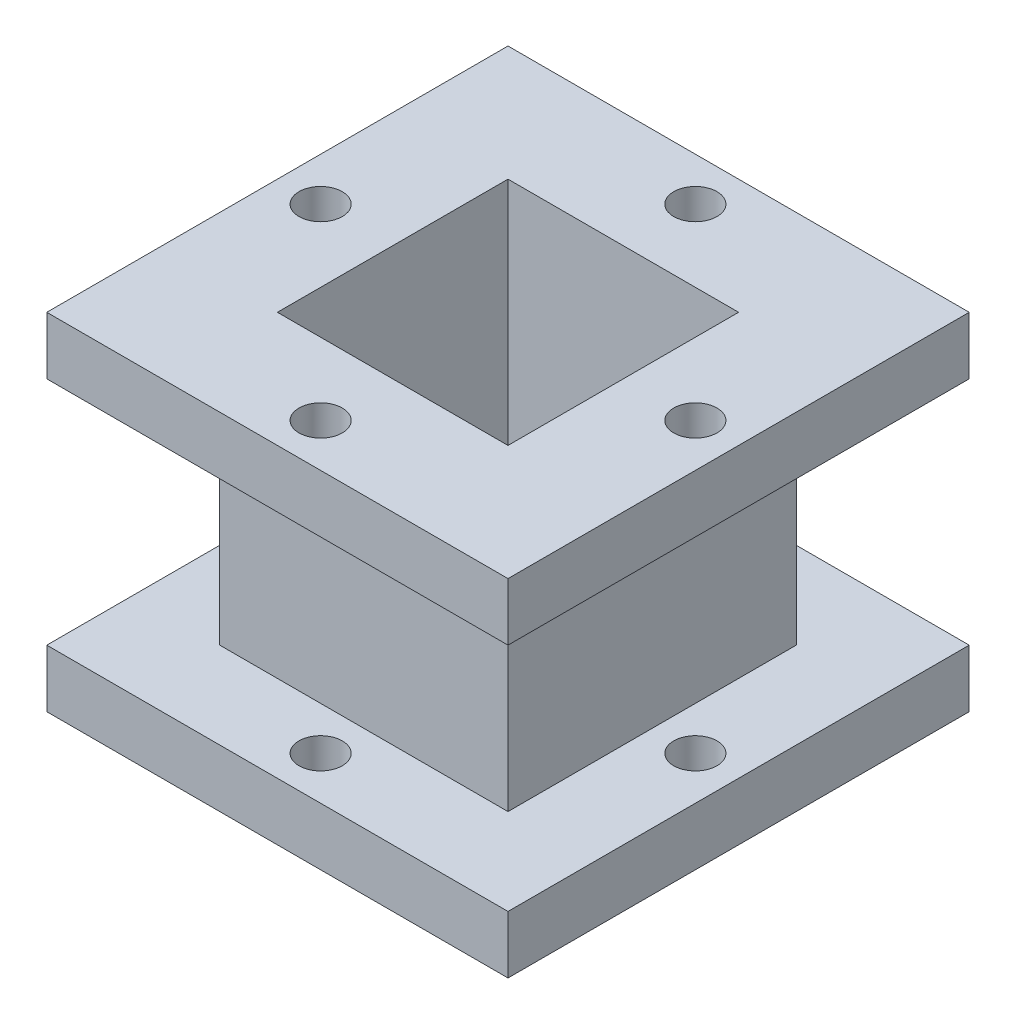
ISO-10303-21;
HEADER;
FILE_DESCRIPTION(('STEP AP214'),'2;1');
FILE_NAME('part.step','',(''),(''),'','','');
FILE_SCHEMA(('AUTOMOTIVE_DESIGN { 1 0 10303 214 1 1 1 1 }'));
ENDSEC;
DATA;
#1=APPLICATION_CONTEXT('core data for automotive mechanical design processes');
#2=APPLICATION_PROTOCOL_DEFINITION('international standard','automotive_design',2000,#1);
#3=PRODUCT_CONTEXT('',#1,'mechanical');
#4=PRODUCT('Part','Part','',(#3));
#5=PRODUCT_RELATED_PRODUCT_CATEGORY('part','',(#4));
#6=PRODUCT_DEFINITION_FORMATION('','',#4);
#7=PRODUCT_DEFINITION_CONTEXT('part definition',#1,'design');
#8=PRODUCT_DEFINITION('design','',#6,#7);
#9=PRODUCT_DEFINITION_SHAPE('','',#8);
#10=(LENGTH_UNIT() NAMED_UNIT(*) SI_UNIT(.MILLI.,.METRE.));
#11=(NAMED_UNIT(*) PLANE_ANGLE_UNIT() SI_UNIT($,.RADIAN.));
#12=(NAMED_UNIT(*) SI_UNIT($,.STERADIAN.) SOLID_ANGLE_UNIT());
#13=UNCERTAINTY_MEASURE_WITH_UNIT(LENGTH_MEASURE(1.E-05),#10,'distance_accuracy_value','');
#14=(GEOMETRIC_REPRESENTATION_CONTEXT(3) GLOBAL_UNCERTAINTY_ASSIGNED_CONTEXT((#13)) GLOBAL_UNIT_ASSIGNED_CONTEXT((#10,
#11,#12)) REPRESENTATION_CONTEXT('',''));
#15=CARTESIAN_POINT('',(0.,0.,0.));
#16=DIRECTION('',(0.,0.,1.));
#17=DIRECTION('',(1.,0.,0.));
#18=AXIS2_PLACEMENT_3D('',#15,#16,#17);
#19=CARTESIAN_POINT('',(25.908,6.096,25.908));
#20=DIRECTION('',(-1.,0.,0.));
#21=DIRECTION('',(0.,0.,1.));
#22=AXIS2_PLACEMENT_3D('',#19,#20,#21);
#23=PLANE('',#22);
#24=DIRECTION('',(0.,0.,-1.));
#25=VECTOR('',#24,1.);
#26=CARTESIAN_POINT('',(25.908,-0.381000000000001,25.908));
#27=LINE('',#26,#25);
#28=CARTESIAN_POINT('',(25.908,-0.381000000000001,25.908));
#29=VERTEX_POINT('',#28);
#30=CARTESIAN_POINT('',(25.908,-0.381000000000001,-25.908));
#31=VERTEX_POINT('',#30);
#32=EDGE_CURVE('E243',#29,#31,#27,.T.);
#33=ORIENTED_EDGE('',*,*,#32,.T.);
#34=DIRECTION('',(0.,-1.,0.));
#35=VECTOR('',#34,1.);
#36=CARTESIAN_POINT('',(25.908,6.096,-25.908));
#37=LINE('',#36,#35);
#38=CARTESIAN_POINT('',(25.908,6.096,-25.908));
#39=VERTEX_POINT('',#38);
#40=EDGE_CURVE('E11',#39,#31,#37,.T.);
#41=ORIENTED_EDGE('',*,*,#40,.F.);
#42=DIRECTION('',(0.,0.,-1.));
#43=VECTOR('',#42,1.);
#44=CARTESIAN_POINT('',(25.908,6.096,25.908));
#45=LINE('',#44,#43);
#46=CARTESIAN_POINT('',(25.908,6.096,25.908));
#47=VERTEX_POINT('',#46);
#48=EDGE_CURVE('E250',#47,#39,#45,.T.);
#49=ORIENTED_EDGE('',*,*,#48,.F.);
#50=DIRECTION('',(0.,-1.,0.));
#51=VECTOR('',#50,1.);
#52=CARTESIAN_POINT('',(25.908,6.096,25.908));
#53=LINE('',#52,#51);
#54=EDGE_CURVE('E260',#47,#29,#53,.T.);
#55=ORIENTED_EDGE('',*,*,#54,.T.);
#56=EDGE_LOOP('',(#33,#41,#49,#55));
#57=FACE_BOUND('',#56,.T.);
#58=ADVANCED_FACE('F36',(#57),#23,.F.);
#59=CARTESIAN_POINT('',(-25.908,6.096,-25.908));
#60=DIRECTION('',(0.,0.,1.));
#61=DIRECTION('',(1.,0.,0.));
#62=AXIS2_PLACEMENT_3D('',#59,#60,#61);
#63=PLANE('',#62);
#64=DIRECTION('',(-1.,0.,0.));
#65=VECTOR('',#64,1.);
#66=CARTESIAN_POINT('',(-25.908,-0.381000000000001,-25.908));
#67=LINE('',#66,#65);
#68=CARTESIAN_POINT('',(-25.908,-0.381000000000001,-25.908));
#69=VERTEX_POINT('',#68);
#70=EDGE_CURVE('E263',#31,#69,#67,.T.);
#71=ORIENTED_EDGE('',*,*,#70,.T.);
#72=DIRECTION('',(0.,-1.,0.));
#73=VECTOR('',#72,1.);
#74=CARTESIAN_POINT('',(-25.908,6.096,-25.908));
#75=LINE('',#74,#73);
#76=CARTESIAN_POINT('',(-25.908,6.096,-25.908));
#77=VERTEX_POINT('',#76);
#78=EDGE_CURVE('E43',#77,#69,#75,.T.);
#79=ORIENTED_EDGE('',*,*,#78,.F.);
#80=DIRECTION('',(-1.,0.,0.));
#81=VECTOR('',#80,1.);
#82=CARTESIAN_POINT('',(-25.908,6.096,-25.908));
#83=LINE('',#82,#81);
#84=EDGE_CURVE('E253',#39,#77,#83,.T.);
#85=ORIENTED_EDGE('',*,*,#84,.F.);
#86=ORIENTED_EDGE('',*,*,#40,.T.);
#87=EDGE_LOOP('',(#71,#79,#85,#86));
#88=FACE_BOUND('',#87,.T.);
#89=ADVANCED_FACE('F291',(#88),#63,.F.);
#90=CARTESIAN_POINT('',(-25.908,6.096,25.908));
#91=DIRECTION('',(1.,0.,0.));
#92=DIRECTION('',(0.,0.,-1.));
#93=AXIS2_PLACEMENT_3D('',#90,#91,#92);
#94=PLANE('',#93);
#95=DIRECTION('',(0.,0.,1.));
#96=VECTOR('',#95,1.);
#97=CARTESIAN_POINT('',(-25.908,-0.381000000000001,25.908));
#98=LINE('',#97,#96);
#99=CARTESIAN_POINT('',(-25.908,-0.381000000000001,25.908));
#100=VERTEX_POINT('',#99);
#101=EDGE_CURVE('E265',#69,#100,#98,.T.);
#102=ORIENTED_EDGE('',*,*,#101,.T.);
#103=DIRECTION('',(0.,-1.,0.));
#104=VECTOR('',#103,1.);
#105=CARTESIAN_POINT('',(-25.908,6.096,25.908));
#106=LINE('',#105,#104);
#107=CARTESIAN_POINT('',(-25.908,6.096,25.908));
#108=VERTEX_POINT('',#107);
#109=EDGE_CURVE('E270',#108,#100,#106,.T.);
#110=ORIENTED_EDGE('',*,*,#109,.F.);
#111=DIRECTION('',(0.,0.,1.));
#112=VECTOR('',#111,1.);
#113=CARTESIAN_POINT('',(-25.908,6.096,25.908));
#114=LINE('',#113,#112);
#115=EDGE_CURVE('E256',#77,#108,#114,.T.);
#116=ORIENTED_EDGE('',*,*,#115,.F.);
#117=ORIENTED_EDGE('',*,*,#78,.T.);
#118=EDGE_LOOP('',(#102,#110,#116,#117));
#119=FACE_BOUND('',#118,.T.);
#120=ADVANCED_FACE('F277',(#119),#94,.F.);
#121=CARTESIAN_POINT('',(-25.908,6.096,25.908));
#122=DIRECTION('',(0.,0.,-1.));
#123=DIRECTION('',(-1.,0.,0.));
#124=AXIS2_PLACEMENT_3D('',#121,#122,#123);
#125=PLANE('',#124);
#126=DIRECTION('',(1.,0.,0.));
#127=VECTOR('',#126,1.);
#128=CARTESIAN_POINT('',(-25.908,-0.381000000000001,25.908));
#129=LINE('',#128,#127);
#130=EDGE_CURVE('E254',#100,#29,#129,.T.);
#131=ORIENTED_EDGE('',*,*,#130,.T.);
#132=ORIENTED_EDGE('',*,*,#54,.F.);
#133=DIRECTION('',(1.,0.,0.));
#134=VECTOR('',#133,1.);
#135=CARTESIAN_POINT('',(-25.908,6.096,25.908));
#136=LINE('',#135,#134);
#137=EDGE_CURVE('E258',#108,#47,#136,.T.);
#138=ORIENTED_EDGE('',*,*,#137,.F.);
#139=ORIENTED_EDGE('',*,*,#109,.T.);
#140=EDGE_LOOP('',(#131,#132,#138,#139));
#141=FACE_BOUND('',#140,.T.);
#142=ADVANCED_FACE('F284',(#141),#125,.F.);
#143=CARTESIAN_POINT('',(0.,6.096,0.));
#144=DIRECTION('',(0.,-1.,0.));
#145=DIRECTION('',(0.,0.,-1.));
#146=AXIS2_PLACEMENT_3D('',#143,#144,#145);
#147=PLANE('',#146);
#148=CARTESIAN_POINT('',(21.05025,6.096,0.));
#149=DIRECTION('',(0.,-1.,0.));
#150=DIRECTION('',(0.,0.,-1.));
#151=AXIS2_PLACEMENT_3D('',#148,#149,#150);
#152=CIRCLE('',#151,2.428875);
#153=CARTESIAN_POINT('',(21.05025,6.096,-2.42887500000007));
#154=VERTEX_POINT('',#153);
#155=EDGE_CURVE('E395',#154,#154,#152,.T.);
#156=ORIENTED_EDGE('',*,*,#155,.T.);
#157=EDGE_LOOP('',(#156));
#158=FACE_BOUND('',#157,.T.);
#159=CARTESIAN_POINT('',(0.,6.096,-21.05025));
#160=DIRECTION('',(0.,-1.,0.));
#161=DIRECTION('',(0.,0.,-1.));
#162=AXIS2_PLACEMENT_3D('',#159,#160,#161);
#163=CIRCLE('',#162,2.428875);
#164=CARTESIAN_POINT('',(0.,6.096,-23.479125));
#165=VERTEX_POINT('',#164);
#166=EDGE_CURVE('E402',#165,#165,#163,.T.);
#167=ORIENTED_EDGE('',*,*,#166,.T.);
#168=EDGE_LOOP('',(#167));
#169=FACE_BOUND('',#168,.T.);
#170=CARTESIAN_POINT('',(-21.05025,6.096,2.20581385564447E-13));
#171=DIRECTION('',(0.,-1.,0.));
#172=DIRECTION('',(0.,0.,-1.));
#173=AXIS2_PLACEMENT_3D('',#170,#171,#172);
#174=CIRCLE('',#173,2.428875);
#175=CARTESIAN_POINT('',(-21.05025,6.096,-2.42887499999978));
#176=VERTEX_POINT('',#175);
#177=EDGE_CURVE('E614',#176,#176,#174,.T.);
#178=ORIENTED_EDGE('',*,*,#177,.T.);
#179=EDGE_LOOP('',(#178));
#180=FACE_BOUND('',#179,.T.);
#181=CARTESIAN_POINT('',(0.,6.096,21.05025));
#182=DIRECTION('',(0.,-1.,0.));
#183=DIRECTION('',(0.,0.,-1.));
#184=AXIS2_PLACEMENT_3D('',#181,#182,#183);
#185=CIRCLE('',#184,2.428875);
#186=CARTESIAN_POINT('',(0.,6.096,18.621375));
#187=VERTEX_POINT('',#186);
#188=EDGE_CURVE('E172',#187,#187,#185,.T.);
#189=ORIENTED_EDGE('',*,*,#188,.T.);
#190=EDGE_LOOP('',(#189));
#191=FACE_BOUND('',#190,.T.);
#192=DIRECTION('',(0.,0.,-1.));
#193=VECTOR('',#192,1.);
#194=CARTESIAN_POINT('',(-16.1925,6.096,16.1925));
#195=LINE('',#194,#193);
#196=CARTESIAN_POINT('',(-16.1925,6.096,16.1925));
#197=VERTEX_POINT('',#196);
#198=CARTESIAN_POINT('',(-16.1925,6.096,-16.1925));
#199=VERTEX_POINT('',#198);
#200=EDGE_CURVE('E221',#197,#199,#195,.T.);
#201=ORIENTED_EDGE('',*,*,#200,.T.);
#202=DIRECTION('',(1.,0.,0.));
#203=VECTOR('',#202,1.);
#204=CARTESIAN_POINT('',(-16.1925,6.096,-16.1925));
#205=LINE('',#204,#203);
#206=CARTESIAN_POINT('',(16.1925,6.096,-16.1925));
#207=VERTEX_POINT('',#206);
#208=EDGE_CURVE('E217',#199,#207,#205,.T.);
#209=ORIENTED_EDGE('',*,*,#208,.T.);
#210=DIRECTION('',(0.,0.,-1.));
#211=VECTOR('',#210,1.);
#212=CARTESIAN_POINT('',(16.1925,6.096,16.1925));
#213=LINE('',#212,#211);
#214=CARTESIAN_POINT('',(16.1925,6.096,16.1925));
#215=VERTEX_POINT('',#214);
#216=EDGE_CURVE('E233',#215,#207,#213,.T.);
#217=ORIENTED_EDGE('',*,*,#216,.F.);
#218=DIRECTION('',(1.,0.,0.));
#219=VECTOR('',#218,1.);
#220=CARTESIAN_POINT('',(-16.1925,6.096,16.1925));
#221=LINE('',#220,#219);
#222=EDGE_CURVE('E236',#197,#215,#221,.T.);
#223=ORIENTED_EDGE('',*,*,#222,.F.);
#224=EDGE_LOOP('',(#201,#209,#217,#223));
#225=FACE_BOUND('',#224,.T.);
#226=ORIENTED_EDGE('',*,*,#48,.T.);
#227=ORIENTED_EDGE('',*,*,#84,.T.);
#228=ORIENTED_EDGE('',*,*,#115,.T.);
#229=ORIENTED_EDGE('',*,*,#137,.T.);
#230=EDGE_LOOP('',(#226,#227,#228,#229));
#231=FACE_BOUND('',#230,.T.);
#232=ADVANCED_FACE('F290',(#158,#169,#180,#191,#225,#231),#147,.F.);
#233=CARTESIAN_POINT('',(0.,-0.381000000000001,0.));
#234=DIRECTION('',(0.,-1.,0.));
#235=DIRECTION('',(0.,0.,-1.));
#236=AXIS2_PLACEMENT_3D('',#233,#234,#235);
#237=PLANE('',#236);
#238=CARTESIAN_POINT('',(21.05025,-0.381000000000001,0.));
#239=DIRECTION('',(0.,1.,0.));
#240=DIRECTION('',(1.,0.,0.));
#241=AXIS2_PLACEMENT_3D('',#238,#239,#240);
#242=CIRCLE('',#241,2.428875);
#243=CARTESIAN_POINT('',(23.479125,-0.381000000000001,0.));
#244=VERTEX_POINT('',#243);
#245=EDGE_CURVE('E392',#244,#244,#242,.T.);
#246=ORIENTED_EDGE('',*,*,#245,.T.);
#247=EDGE_LOOP('',(#246));
#248=FACE_BOUND('',#247,.T.);
#249=CARTESIAN_POINT('',(0.,-0.381000000000001,-21.05025));
#250=DIRECTION('',(0.,1.,0.));
#251=DIRECTION('',(0.,0.,-1.));
#252=AXIS2_PLACEMENT_3D('',#249,#250,#251);
#253=CIRCLE('',#252,2.428875);
#254=CARTESIAN_POINT('',(0.,-0.381000000000001,-23.479125));
#255=VERTEX_POINT('',#254);
#256=EDGE_CURVE('E629',#255,#255,#253,.T.);
#257=ORIENTED_EDGE('',*,*,#256,.T.);
#258=EDGE_LOOP('',(#257));
#259=FACE_BOUND('',#258,.T.);
#260=CARTESIAN_POINT('',(-21.05025,-0.381000000000001,2.20581385564447E-13));
#261=DIRECTION('',(0.,1.,0.));
#262=DIRECTION('',(-1.,0.,0.));
#263=AXIS2_PLACEMENT_3D('',#260,#261,#262);
#264=CIRCLE('',#263,2.428875);
#265=CARTESIAN_POINT('',(-23.479125,-0.381000000000001,2.46022500775095E-13));
#266=VERTEX_POINT('',#265);
#267=EDGE_CURVE('E623',#266,#266,#264,.T.);
#268=ORIENTED_EDGE('',*,*,#267,.T.);
#269=EDGE_LOOP('',(#268));
#270=FACE_BOUND('',#269,.T.);
#271=CARTESIAN_POINT('',(0.,-0.381000000000001,21.05025));
#272=DIRECTION('',(0.,1.,0.));
#273=DIRECTION('',(0.,0.,1.));
#274=AXIS2_PLACEMENT_3D('',#271,#272,#273);
#275=CIRCLE('',#274,2.428875);
#276=CARTESIAN_POINT('',(0.,-0.381000000000001,23.479125));
#277=VERTEX_POINT('',#276);
#278=EDGE_CURVE('E400',#277,#277,#275,.T.);
#279=ORIENTED_EDGE('',*,*,#278,.T.);
#280=EDGE_LOOP('',(#279));
#281=FACE_BOUND('',#280,.T.);
#282=DIRECTION('',(0.,0.,-1.));
#283=VECTOR('',#282,1.);
#284=CARTESIAN_POINT('',(12.954,-0.381000000000001,12.954));
#285=LINE('',#284,#283);
#286=CARTESIAN_POINT('',(12.954,-0.381000000000001,12.954));
#287=VERTEX_POINT('',#286);
#288=CARTESIAN_POINT('',(12.954,-0.381000000000001,-12.954));
#289=VERTEX_POINT('',#288);
#290=EDGE_CURVE('E150',#287,#289,#285,.T.);
#291=ORIENTED_EDGE('',*,*,#290,.T.);
#292=DIRECTION('',(-1.,0.,0.));
#293=VECTOR('',#292,1.);
#294=CARTESIAN_POINT('',(-12.954,-0.381000000000001,-12.954));
#295=LINE('',#294,#293);
#296=CARTESIAN_POINT('',(-12.954,-0.381000000000001,-12.954));
#297=VERTEX_POINT('',#296);
#298=EDGE_CURVE('E159',#289,#297,#295,.T.);
#299=ORIENTED_EDGE('',*,*,#298,.T.);
#300=DIRECTION('',(0.,0.,1.));
#301=VECTOR('',#300,1.);
#302=CARTESIAN_POINT('',(-12.954,-0.381000000000001,12.954));
#303=LINE('',#302,#301);
#304=CARTESIAN_POINT('',(-12.954,-0.381000000000001,12.954));
#305=VERTEX_POINT('',#304);
#306=EDGE_CURVE('E50',#297,#305,#303,.T.);
#307=ORIENTED_EDGE('',*,*,#306,.T.);
#308=DIRECTION('',(1.,0.,0.));
#309=VECTOR('',#308,1.);
#310=CARTESIAN_POINT('',(-12.954,-0.381000000000001,12.954));
#311=LINE('',#310,#309);
#312=EDGE_CURVE('E156',#305,#287,#311,.T.);
#313=ORIENTED_EDGE('',*,*,#312,.T.);
#314=EDGE_LOOP('',(#291,#299,#307,#313));
#315=FACE_BOUND('',#314,.T.);
#316=ORIENTED_EDGE('',*,*,#32,.F.);
#317=ORIENTED_EDGE('',*,*,#130,.F.);
#318=ORIENTED_EDGE('',*,*,#101,.F.);
#319=ORIENTED_EDGE('',*,*,#70,.F.);
#320=EDGE_LOOP('',(#316,#317,#318,#319));
#321=FACE_BOUND('',#320,.T.);
#322=ADVANCED_FACE('F163',(#248,#259,#270,#281,#315,#321),#237,.T.);
#323=CARTESIAN_POINT('',(-16.1925,32.004,-16.1925));
#324=DIRECTION('',(0.,0.,-1.));
#325=DIRECTION('',(-1.,0.,0.));
#326=AXIS2_PLACEMENT_3D('',#323,#324,#325);
#327=PLANE('',#326);
#328=ORIENTED_EDGE('',*,*,#208,.F.);
#329=DIRECTION('',(0.,-1.,0.));
#330=VECTOR('',#329,1.);
#331=CARTESIAN_POINT('',(-16.1925,32.004,-16.1925));
#332=LINE('',#331,#330);
#333=CARTESIAN_POINT('',(-16.1925,32.004,-16.1925));
#334=VERTEX_POINT('',#333);
#335=EDGE_CURVE('E240',#334,#199,#332,.T.);
#336=ORIENTED_EDGE('',*,*,#335,.F.);
#337=DIRECTION('',(1.,0.,0.));
#338=VECTOR('',#337,1.);
#339=CARTESIAN_POINT('',(-16.1925,32.004,-16.1925));
#340=LINE('',#339,#338);
#341=CARTESIAN_POINT('',(16.1925,32.004,-16.1925));
#342=VERTEX_POINT('',#341);
#343=EDGE_CURVE('E218',#334,#342,#340,.T.);
#344=ORIENTED_EDGE('',*,*,#343,.T.);
#345=DIRECTION('',(0.,-1.,0.));
#346=VECTOR('',#345,1.);
#347=CARTESIAN_POINT('',(16.1925,32.004,-16.1925));
#348=LINE('',#347,#346);
#349=EDGE_CURVE('E230',#342,#207,#348,.T.);
#350=ORIENTED_EDGE('',*,*,#349,.T.);
#351=EDGE_LOOP('',(#328,#336,#344,#350));
#352=FACE_BOUND('',#351,.T.);
#353=ADVANCED_FACE('F303',(#352),#327,.T.);
#354=CARTESIAN_POINT('',(-16.1925,32.004,16.1925));
#355=DIRECTION('',(-1.,0.,0.));
#356=DIRECTION('',(0.,0.,1.));
#357=AXIS2_PLACEMENT_3D('',#354,#355,#356);
#358=PLANE('',#357);
#359=ORIENTED_EDGE('',*,*,#200,.F.);
#360=DIRECTION('',(0.,-1.,0.));
#361=VECTOR('',#360,1.);
#362=CARTESIAN_POINT('',(-16.1925,32.004,16.1925));
#363=LINE('',#362,#361);
#364=CARTESIAN_POINT('',(-16.1925,32.004,16.1925));
#365=VERTEX_POINT('',#364);
#366=EDGE_CURVE('E244',#365,#197,#363,.T.);
#367=ORIENTED_EDGE('',*,*,#366,.F.);
#368=DIRECTION('',(0.,0.,-1.));
#369=VECTOR('',#368,1.);
#370=CARTESIAN_POINT('',(-16.1925,32.004,16.1925));
#371=LINE('',#370,#369);
#372=EDGE_CURVE('E227',#365,#334,#371,.T.);
#373=ORIENTED_EDGE('',*,*,#372,.T.);
#374=ORIENTED_EDGE('',*,*,#335,.T.);
#375=EDGE_LOOP('',(#359,#367,#373,#374));
#376=FACE_BOUND('',#375,.T.);
#377=ADVANCED_FACE('F310',(#376),#358,.T.);
#378=CARTESIAN_POINT('',(-16.1925,32.004,16.1925));
#379=DIRECTION('',(0.,0.,-1.));
#380=DIRECTION('',(-1.,0.,0.));
#381=AXIS2_PLACEMENT_3D('',#378,#379,#380);
#382=PLANE('',#381);
#383=ORIENTED_EDGE('',*,*,#222,.T.);
#384=DIRECTION('',(0.,-1.,0.));
#385=VECTOR('',#384,1.);
#386=CARTESIAN_POINT('',(16.1925,32.004,16.1925));
#387=LINE('',#386,#385);
#388=CARTESIAN_POINT('',(16.1925,32.004,16.1925));
#389=VERTEX_POINT('',#388);
#390=EDGE_CURVE('E246',#389,#215,#387,.T.);
#391=ORIENTED_EDGE('',*,*,#390,.F.);
#392=DIRECTION('',(1.,0.,0.));
#393=VECTOR('',#392,1.);
#394=CARTESIAN_POINT('',(-16.1925,32.004,16.1925));
#395=LINE('',#394,#393);
#396=EDGE_CURVE('E224',#365,#389,#395,.T.);
#397=ORIENTED_EDGE('',*,*,#396,.F.);
#398=ORIENTED_EDGE('',*,*,#366,.T.);
#399=EDGE_LOOP('',(#383,#391,#397,#398));
#400=FACE_BOUND('',#399,.T.);
#401=ADVANCED_FACE('F316',(#400),#382,.F.);
#402=CARTESIAN_POINT('',(16.1925,32.004,16.1925));
#403=DIRECTION('',(-1.,0.,0.));
#404=DIRECTION('',(0.,0.,1.));
#405=AXIS2_PLACEMENT_3D('',#402,#403,#404);
#406=PLANE('',#405);
#407=ORIENTED_EDGE('',*,*,#216,.T.);
#408=ORIENTED_EDGE('',*,*,#349,.F.);
#409=DIRECTION('',(0.,0.,-1.));
#410=VECTOR('',#409,1.);
#411=CARTESIAN_POINT('',(16.1925,32.004,16.1925));
#412=LINE('',#411,#410);
#413=EDGE_CURVE('E220',#389,#342,#412,.T.);
#414=ORIENTED_EDGE('',*,*,#413,.F.);
#415=ORIENTED_EDGE('',*,*,#390,.T.);
#416=EDGE_LOOP('',(#407,#408,#414,#415));
#417=FACE_BOUND('',#416,.T.);
#418=ADVANCED_FACE('F312',(#417),#406,.F.);
#419=CARTESIAN_POINT('',(0.,32.004,0.));
#420=DIRECTION('',(0.,-1.,0.));
#421=DIRECTION('',(0.,0.,-1.));
#422=AXIS2_PLACEMENT_3D('',#419,#420,#421);
#423=PLANE('',#422);
#424=CARTESIAN_POINT('',(21.05025,32.004,0.));
#425=DIRECTION('',(0.,-1.,0.));
#426=DIRECTION('',(0.,0.,-1.));
#427=AXIS2_PLACEMENT_3D('',#424,#425,#426);
#428=CIRCLE('',#427,2.428875);
#429=CARTESIAN_POINT('',(21.05025,32.004,-2.42887500000007));
#430=VERTEX_POINT('',#429);
#431=EDGE_CURVE('E397',#430,#430,#428,.T.);
#432=ORIENTED_EDGE('',*,*,#431,.F.);
#433=EDGE_LOOP('',(#432));
#434=FACE_BOUND('',#433,.T.);
#435=CARTESIAN_POINT('',(0.,32.004,-21.05025));
#436=DIRECTION('',(0.,-1.,0.));
#437=DIRECTION('',(0.,0.,-1.));
#438=AXIS2_PLACEMENT_3D('',#435,#436,#437);
#439=CIRCLE('',#438,2.428875);
#440=CARTESIAN_POINT('',(0.,32.004,-23.479125));
#441=VERTEX_POINT('',#440);
#442=EDGE_CURVE('E611',#441,#441,#439,.T.);
#443=ORIENTED_EDGE('',*,*,#442,.F.);
#444=EDGE_LOOP('',(#443));
#445=FACE_BOUND('',#444,.T.);
#446=CARTESIAN_POINT('',(-21.05025,32.004,2.20581385564447E-13));
#447=DIRECTION('',(0.,-1.,0.));
#448=DIRECTION('',(0.,0.,-1.));
#449=AXIS2_PLACEMENT_3D('',#446,#447,#448);
#450=CIRCLE('',#449,2.428875);
#451=CARTESIAN_POINT('',(-21.05025,32.004,-2.42887499999978));
#452=VERTEX_POINT('',#451);
#453=EDGE_CURVE('E617',#452,#452,#450,.T.);
#454=ORIENTED_EDGE('',*,*,#453,.F.);
#455=EDGE_LOOP('',(#454));
#456=FACE_BOUND('',#455,.T.);
#457=CARTESIAN_POINT('',(0.,32.004,21.05025));
#458=DIRECTION('',(0.,-1.,0.));
#459=DIRECTION('',(0.,0.,-1.));
#460=AXIS2_PLACEMENT_3D('',#457,#458,#459);
#461=CIRCLE('',#460,2.428875);
#462=CARTESIAN_POINT('',(0.,32.004,18.621375));
#463=VERTEX_POINT('',#462);
#464=EDGE_CURVE('E407',#463,#463,#461,.T.);
#465=ORIENTED_EDGE('',*,*,#464,.F.);
#466=EDGE_LOOP('',(#465));
#467=FACE_BOUND('',#466,.T.);
#468=DIRECTION('',(0.,0.,-1.));
#469=VECTOR('',#468,1.);
#470=CARTESIAN_POINT('',(25.908,32.004,25.908));
#471=LINE('',#470,#469);
#472=CARTESIAN_POINT('',(25.908,32.004,25.908));
#473=VERTEX_POINT('',#472);
#474=CARTESIAN_POINT('',(25.908,32.004,-25.908));
#475=VERTEX_POINT('',#474);
#476=EDGE_CURVE('E184',#473,#475,#471,.T.);
#477=ORIENTED_EDGE('',*,*,#476,.F.);
#478=DIRECTION('',(1.,0.,0.));
#479=VECTOR('',#478,1.);
#480=CARTESIAN_POINT('',(-25.908,32.004,25.908));
#481=LINE('',#480,#479);
#482=CARTESIAN_POINT('',(-25.908,32.004,25.908));
#483=VERTEX_POINT('',#482);
#484=EDGE_CURVE('E192',#483,#473,#481,.T.);
#485=ORIENTED_EDGE('',*,*,#484,.F.);
#486=DIRECTION('',(0.,0.,1.));
#487=VECTOR('',#486,1.);
#488=CARTESIAN_POINT('',(-25.908,32.004,25.908));
#489=LINE('',#488,#487);
#490=CARTESIAN_POINT('',(-25.908,32.004,-25.908));
#491=VERTEX_POINT('',#490);
#492=EDGE_CURVE('E203',#491,#483,#489,.T.);
#493=ORIENTED_EDGE('',*,*,#492,.F.);
#494=DIRECTION('',(-1.,0.,0.));
#495=VECTOR('',#494,1.);
#496=CARTESIAN_POINT('',(-25.908,32.004,-25.908));
#497=LINE('',#496,#495);
#498=EDGE_CURVE('E201',#475,#491,#497,.T.);
#499=ORIENTED_EDGE('',*,*,#498,.F.);
#500=EDGE_LOOP('',(#477,#485,#493,#499));
#501=FACE_BOUND('',#500,.T.);
#502=ORIENTED_EDGE('',*,*,#343,.F.);
#503=ORIENTED_EDGE('',*,*,#372,.F.);
#504=ORIENTED_EDGE('',*,*,#396,.T.);
#505=ORIENTED_EDGE('',*,*,#413,.T.);
#506=EDGE_LOOP('',(#502,#503,#504,#505));
#507=FACE_BOUND('',#506,.T.);
#508=ADVANCED_FACE('F315',(#434,#445,#456,#467,#501,#507),#423,.T.);
#509=CARTESIAN_POINT('',(25.908,38.481,25.908));
#510=DIRECTION('',(-1.,0.,0.));
#511=DIRECTION('',(0.,0.,1.));
#512=AXIS2_PLACEMENT_3D('',#509,#510,#511);
#513=PLANE('',#512);
#514=ORIENTED_EDGE('',*,*,#476,.T.);
#515=DIRECTION('',(0.,-1.,0.));
#516=VECTOR('',#515,1.);
#517=CARTESIAN_POINT('',(25.908,38.481,-25.908));
#518=LINE('',#517,#516);
#519=CARTESIAN_POINT('',(25.908,38.481,-25.908));
#520=VERTEX_POINT('',#519);
#521=EDGE_CURVE('E214',#520,#475,#518,.T.);
#522=ORIENTED_EDGE('',*,*,#521,.F.);
#523=DIRECTION('',(0.,0.,-1.));
#524=VECTOR('',#523,1.);
#525=CARTESIAN_POINT('',(25.908,38.481,25.908));
#526=LINE('',#525,#524);
#527=CARTESIAN_POINT('',(25.908,38.481,25.908));
#528=VERTEX_POINT('',#527);
#529=EDGE_CURVE('E188',#528,#520,#526,.T.);
#530=ORIENTED_EDGE('',*,*,#529,.F.);
#531=DIRECTION('',(0.,-1.,0.));
#532=VECTOR('',#531,1.);
#533=CARTESIAN_POINT('',(25.908,38.481,25.908));
#534=LINE('',#533,#532);
#535=EDGE_CURVE('E198',#528,#473,#534,.T.);
#536=ORIENTED_EDGE('',*,*,#535,.T.);
#537=EDGE_LOOP('',(#514,#522,#530,#536));
#538=FACE_BOUND('',#537,.T.);
#539=ADVANCED_FACE('F324',(#538),#513,.F.);
#540=CARTESIAN_POINT('',(-25.908,38.481,-25.908));
#541=DIRECTION('',(0.,0.,1.));
#542=DIRECTION('',(1.,0.,0.));
#543=AXIS2_PLACEMENT_3D('',#540,#541,#542);
#544=PLANE('',#543);
#545=ORIENTED_EDGE('',*,*,#498,.T.);
#546=DIRECTION('',(0.,-1.,0.));
#547=VECTOR('',#546,1.);
#548=CARTESIAN_POINT('',(-25.908,38.481,-25.908));
#549=LINE('',#548,#547);
#550=CARTESIAN_POINT('',(-25.908,38.481,-25.908));
#551=VERTEX_POINT('',#550);
#552=EDGE_CURVE('E211',#551,#491,#549,.T.);
#553=ORIENTED_EDGE('',*,*,#552,.F.);
#554=DIRECTION('',(-1.,0.,0.));
#555=VECTOR('',#554,1.);
#556=CARTESIAN_POINT('',(-25.908,38.481,-25.908));
#557=LINE('',#556,#555);
#558=EDGE_CURVE('E191',#520,#551,#557,.T.);
#559=ORIENTED_EDGE('',*,*,#558,.F.);
#560=ORIENTED_EDGE('',*,*,#521,.T.);
#561=EDGE_LOOP('',(#545,#553,#559,#560));
#562=FACE_BOUND('',#561,.T.);
#563=ADVANCED_FACE('F327',(#562),#544,.F.);
#564=CARTESIAN_POINT('',(-25.908,38.481,25.908));
#565=DIRECTION('',(1.,0.,0.));
#566=DIRECTION('',(0.,0.,-1.));
#567=AXIS2_PLACEMENT_3D('',#564,#565,#566);
#568=PLANE('',#567);
#569=ORIENTED_EDGE('',*,*,#492,.T.);
#570=DIRECTION('',(0.,-1.,0.));
#571=VECTOR('',#570,1.);
#572=CARTESIAN_POINT('',(-25.908,38.481,25.908));
#573=LINE('',#572,#571);
#574=CARTESIAN_POINT('',(-25.908,38.481,25.908));
#575=VERTEX_POINT('',#574);
#576=EDGE_CURVE('E208',#575,#483,#573,.T.);
#577=ORIENTED_EDGE('',*,*,#576,.F.);
#578=DIRECTION('',(0.,0.,1.));
#579=VECTOR('',#578,1.);
#580=CARTESIAN_POINT('',(-25.908,38.481,25.908));
#581=LINE('',#580,#579);
#582=EDGE_CURVE('E194',#551,#575,#581,.T.);
#583=ORIENTED_EDGE('',*,*,#582,.F.);
#584=ORIENTED_EDGE('',*,*,#552,.T.);
#585=EDGE_LOOP('',(#569,#577,#583,#584));
#586=FACE_BOUND('',#585,.T.);
#587=ADVANCED_FACE('F331',(#586),#568,.F.);
#588=CARTESIAN_POINT('',(-25.908,38.481,25.908));
#589=DIRECTION('',(0.,0.,-1.));
#590=DIRECTION('',(-1.,0.,0.));
#591=AXIS2_PLACEMENT_3D('',#588,#589,#590);
#592=PLANE('',#591);
#593=ORIENTED_EDGE('',*,*,#484,.T.);
#594=ORIENTED_EDGE('',*,*,#535,.F.);
#595=DIRECTION('',(1.,0.,0.));
#596=VECTOR('',#595,1.);
#597=CARTESIAN_POINT('',(-25.908,38.481,25.908));
#598=LINE('',#597,#596);
#599=EDGE_CURVE('E196',#575,#528,#598,.T.);
#600=ORIENTED_EDGE('',*,*,#599,.F.);
#601=ORIENTED_EDGE('',*,*,#576,.T.);
#602=EDGE_LOOP('',(#593,#594,#600,#601));
#603=FACE_BOUND('',#602,.T.);
#604=ADVANCED_FACE('F335',(#603),#592,.F.);
#605=CARTESIAN_POINT('',(0.,38.481,0.));
#606=DIRECTION('',(0.,-1.,0.));
#607=DIRECTION('',(0.,0.,-1.));
#608=AXIS2_PLACEMENT_3D('',#605,#606,#607);
#609=PLANE('',#608);
#610=CARTESIAN_POINT('',(21.05025,38.481,0.));
#611=DIRECTION('',(0.,1.,0.));
#612=DIRECTION('',(1.,0.,0.));
#613=AXIS2_PLACEMENT_3D('',#610,#611,#612);
#614=CIRCLE('',#613,2.428875);
#615=CARTESIAN_POINT('',(23.479125,38.481,0.));
#616=VERTEX_POINT('',#615);
#617=EDGE_CURVE('E632',#616,#616,#614,.T.);
#618=ORIENTED_EDGE('',*,*,#617,.F.);
#619=EDGE_LOOP('',(#618));
#620=FACE_BOUND('',#619,.T.);
#621=CARTESIAN_POINT('',(0.,38.481,-21.05025));
#622=DIRECTION('',(0.,1.,0.));
#623=DIRECTION('',(0.,0.,-1.));
#624=AXIS2_PLACEMENT_3D('',#621,#622,#623);
#625=CIRCLE('',#624,2.428875);
#626=CARTESIAN_POINT('',(0.,38.481,-23.479125));
#627=VERTEX_POINT('',#626);
#628=EDGE_CURVE('E626',#627,#627,#625,.T.);
#629=ORIENTED_EDGE('',*,*,#628,.F.);
#630=EDGE_LOOP('',(#629));
#631=FACE_BOUND('',#630,.T.);
#632=CARTESIAN_POINT('',(-21.05025,38.481,2.20581385564447E-13));
#633=DIRECTION('',(0.,1.,0.));
#634=DIRECTION('',(-1.,0.,0.));
#635=AXIS2_PLACEMENT_3D('',#632,#633,#634);
#636=CIRCLE('',#635,2.428875);
#637=CARTESIAN_POINT('',(-23.479125,38.481,2.46022500775095E-13));
#638=VERTEX_POINT('',#637);
#639=EDGE_CURVE('E620',#638,#638,#636,.T.);
#640=ORIENTED_EDGE('',*,*,#639,.F.);
#641=EDGE_LOOP('',(#640));
#642=FACE_BOUND('',#641,.T.);
#643=CARTESIAN_POINT('',(0.,38.481,21.05025));
#644=DIRECTION('',(0.,1.,0.));
#645=DIRECTION('',(0.,0.,1.));
#646=AXIS2_PLACEMENT_3D('',#643,#644,#645);
#647=CIRCLE('',#646,2.428875);
#648=CARTESIAN_POINT('',(0.,38.481,23.479125));
#649=VERTEX_POINT('',#648);
#650=EDGE_CURVE('E396',#649,#649,#647,.T.);
#651=ORIENTED_EDGE('',*,*,#650,.F.);
#652=EDGE_LOOP('',(#651));
#653=FACE_BOUND('',#652,.T.);
#654=DIRECTION('',(-1.,0.,0.));
#655=VECTOR('',#654,1.);
#656=CARTESIAN_POINT('',(-12.954,38.481,-12.954));
#657=LINE('',#656,#655);
#658=CARTESIAN_POINT('',(12.954,38.481,-12.954));
#659=VERTEX_POINT('',#658);
#660=CARTESIAN_POINT('',(-12.954,38.481,-12.954));
#661=VERTEX_POINT('',#660);
#662=EDGE_CURVE('E178',#659,#661,#657,.T.);
#663=ORIENTED_EDGE('',*,*,#662,.F.);
#664=DIRECTION('',(0.,0.,-1.));
#665=VECTOR('',#664,1.);
#666=CARTESIAN_POINT('',(12.954,38.481,12.954));
#667=LINE('',#666,#665);
#668=CARTESIAN_POINT('',(12.954,38.481,12.954));
#669=VERTEX_POINT('',#668);
#670=EDGE_CURVE('E58',#669,#659,#667,.T.);
#671=ORIENTED_EDGE('',*,*,#670,.F.);
#672=DIRECTION('',(1.,0.,0.));
#673=VECTOR('',#672,1.);
#674=CARTESIAN_POINT('',(-12.954,38.481,12.954));
#675=LINE('',#674,#673);
#676=CARTESIAN_POINT('',(-12.954,38.481,12.954));
#677=VERTEX_POINT('',#676);
#678=EDGE_CURVE('E166',#677,#669,#675,.T.);
#679=ORIENTED_EDGE('',*,*,#678,.F.);
#680=DIRECTION('',(0.,0.,1.));
#681=VECTOR('',#680,1.);
#682=CARTESIAN_POINT('',(-12.954,38.481,12.954));
#683=LINE('',#682,#681);
#684=EDGE_CURVE('E169',#661,#677,#683,.T.);
#685=ORIENTED_EDGE('',*,*,#684,.F.);
#686=EDGE_LOOP('',(#663,#671,#679,#685));
#687=FACE_BOUND('',#686,.T.);
#688=ORIENTED_EDGE('',*,*,#529,.T.);
#689=ORIENTED_EDGE('',*,*,#558,.T.);
#690=ORIENTED_EDGE('',*,*,#582,.T.);
#691=ORIENTED_EDGE('',*,*,#599,.T.);
#692=EDGE_LOOP('',(#688,#689,#690,#691));
#693=FACE_BOUND('',#692,.T.);
#694=ADVANCED_FACE('F339',(#620,#631,#642,#653,#687,#693),#609,.F.);
#695=CARTESIAN_POINT('',(12.954,-0.381000000000001,12.954));
#696=DIRECTION('',(1.,0.,0.));
#697=DIRECTION('',(0.,0.,-1.));
#698=AXIS2_PLACEMENT_3D('',#695,#696,#697);
#699=PLANE('',#698);
#700=ORIENTED_EDGE('',*,*,#670,.T.);
#701=DIRECTION('',(0.,1.,0.));
#702=VECTOR('',#701,1.);
#703=CARTESIAN_POINT('',(12.954,-0.381000000000001,-12.954));
#704=LINE('',#703,#702);
#705=EDGE_CURVE('E146',#289,#659,#704,.T.);
#706=ORIENTED_EDGE('',*,*,#705,.F.);
#707=ORIENTED_EDGE('',*,*,#290,.F.);
#708=DIRECTION('',(0.,1.,0.));
#709=VECTOR('',#708,1.);
#710=CARTESIAN_POINT('',(12.954,-0.381000000000001,12.954));
#711=LINE('',#710,#709);
#712=EDGE_CURVE('E182',#287,#669,#711,.T.);
#713=ORIENTED_EDGE('',*,*,#712,.T.);
#714=EDGE_LOOP('',(#700,#706,#707,#713));
#715=FACE_BOUND('',#714,.T.);
#716=ADVANCED_FACE('F148',(#715),#699,.F.);
#717=CARTESIAN_POINT('',(-12.954,-0.381000000000001,12.954));
#718=DIRECTION('',(0.,0.,1.));
#719=DIRECTION('',(1.,0.,0.));
#720=AXIS2_PLACEMENT_3D('',#717,#718,#719);
#721=PLANE('',#720);
#722=ORIENTED_EDGE('',*,*,#678,.T.);
#723=ORIENTED_EDGE('',*,*,#712,.F.);
#724=ORIENTED_EDGE('',*,*,#312,.F.);
#725=DIRECTION('',(0.,1.,0.));
#726=VECTOR('',#725,1.);
#727=CARTESIAN_POINT('',(-12.954,-0.381000000000001,12.954));
#728=LINE('',#727,#726);
#729=EDGE_CURVE('E185',#305,#677,#728,.T.);
#730=ORIENTED_EDGE('',*,*,#729,.T.);
#731=EDGE_LOOP('',(#722,#723,#724,#730));
#732=FACE_BOUND('',#731,.T.);
#733=ADVANCED_FACE('F349',(#732),#721,.F.);
#734=CARTESIAN_POINT('',(-12.954,-0.381000000000001,12.954));
#735=DIRECTION('',(-1.,0.,0.));
#736=DIRECTION('',(0.,0.,1.));
#737=AXIS2_PLACEMENT_3D('',#734,#735,#736);
#738=PLANE('',#737);
#739=ORIENTED_EDGE('',*,*,#684,.T.);
#740=ORIENTED_EDGE('',*,*,#729,.F.);
#741=ORIENTED_EDGE('',*,*,#306,.F.);
#742=DIRECTION('',(0.,1.,0.));
#743=VECTOR('',#742,1.);
#744=CARTESIAN_POINT('',(-12.954,-0.381000000000001,-12.954));
#745=LINE('',#744,#743);
#746=EDGE_CURVE('E155',#297,#661,#745,.T.);
#747=ORIENTED_EDGE('',*,*,#746,.T.);
#748=EDGE_LOOP('',(#739,#740,#741,#747));
#749=FACE_BOUND('',#748,.T.);
#750=ADVANCED_FACE('F353',(#749),#738,.F.);
#751=CARTESIAN_POINT('',(-12.954,-0.381000000000001,-12.954));
#752=DIRECTION('',(0.,0.,-1.));
#753=DIRECTION('',(-1.,0.,0.));
#754=AXIS2_PLACEMENT_3D('',#751,#752,#753);
#755=PLANE('',#754);
#756=ORIENTED_EDGE('',*,*,#662,.T.);
#757=ORIENTED_EDGE('',*,*,#746,.F.);
#758=ORIENTED_EDGE('',*,*,#298,.F.);
#759=ORIENTED_EDGE('',*,*,#705,.T.);
#760=EDGE_LOOP('',(#756,#757,#758,#759));
#761=FACE_BOUND('',#760,.T.);
#762=ADVANCED_FACE('F160',(#761),#755,.F.);
#763=CARTESIAN_POINT('',(0.,-0.381000000000001,21.05025));
#764=DIRECTION('',(0.,1.,0.));
#765=DIRECTION('',(0.,0.,1.));
#766=AXIS2_PLACEMENT_3D('',#763,#764,#765);
#767=CYLINDRICAL_SURFACE('',#766,2.428875);
#768=ORIENTED_EDGE('',*,*,#464,.T.);
#769=EDGE_LOOP('',(#768));
#770=FACE_BOUND('',#769,.T.);
#771=ORIENTED_EDGE('',*,*,#650,.T.);
#772=EDGE_LOOP('',(#771));
#773=FACE_BOUND('',#772,.T.);
#774=ADVANCED_FACE('F352',(#770,#773),#767,.F.);
#775=ORIENTED_EDGE('',*,*,#278,.F.);
#776=EDGE_LOOP('',(#775));
#777=FACE_BOUND('',#776,.T.);
#778=ORIENTED_EDGE('',*,*,#188,.F.);
#779=EDGE_LOOP('',(#778));
#780=FACE_BOUND('',#779,.T.);
#781=ADVANCED_FACE('F361',(#777,#780),#767,.F.);
#782=CARTESIAN_POINT('',(-21.05025,-0.381000000000001,2.20581385564447E-13));
#783=DIRECTION('',(0.,1.,0.));
#784=DIRECTION('',(0.,0.,1.));
#785=AXIS2_PLACEMENT_3D('',#782,#783,#784);
#786=CYLINDRICAL_SURFACE('',#785,2.428875);
#787=ORIENTED_EDGE('',*,*,#453,.T.);
#788=EDGE_LOOP('',(#787));
#789=FACE_BOUND('',#788,.T.);
#790=ORIENTED_EDGE('',*,*,#639,.T.);
#791=EDGE_LOOP('',(#790));
#792=FACE_BOUND('',#791,.T.);
#793=ADVANCED_FACE('F363',(#789,#792),#786,.F.);
#794=CARTESIAN_POINT('',(0.,-0.381000000000001,-21.05025));
#795=DIRECTION('',(0.,1.,0.));
#796=DIRECTION('',(0.,0.,1.));
#797=AXIS2_PLACEMENT_3D('',#794,#795,#796);
#798=CYLINDRICAL_SURFACE('',#797,2.428875);
#799=ORIENTED_EDGE('',*,*,#442,.T.);
#800=EDGE_LOOP('',(#799));
#801=FACE_BOUND('',#800,.T.);
#802=ORIENTED_EDGE('',*,*,#628,.T.);
#803=EDGE_LOOP('',(#802));
#804=FACE_BOUND('',#803,.T.);
#805=ADVANCED_FACE('F366',(#801,#804),#798,.F.);
#806=CARTESIAN_POINT('',(21.05025,-0.381000000000001,0.));
#807=DIRECTION('',(0.,1.,0.));
#808=DIRECTION('',(0.,0.,1.));
#809=AXIS2_PLACEMENT_3D('',#806,#807,#808);
#810=CYLINDRICAL_SURFACE('',#809,2.428875);
#811=ORIENTED_EDGE('',*,*,#431,.T.);
#812=EDGE_LOOP('',(#811));
#813=FACE_BOUND('',#812,.T.);
#814=ORIENTED_EDGE('',*,*,#617,.T.);
#815=EDGE_LOOP('',(#814));
#816=FACE_BOUND('',#815,.T.);
#817=ADVANCED_FACE('F371',(#813,#816),#810,.F.);
#818=ORIENTED_EDGE('',*,*,#267,.F.);
#819=EDGE_LOOP('',(#818));
#820=FACE_BOUND('',#819,.T.);
#821=ORIENTED_EDGE('',*,*,#177,.F.);
#822=EDGE_LOOP('',(#821));
#823=FACE_BOUND('',#822,.T.);
#824=ADVANCED_FACE('F368',(#820,#823),#786,.F.);
#825=ORIENTED_EDGE('',*,*,#256,.F.);
#826=EDGE_LOOP('',(#825));
#827=FACE_BOUND('',#826,.T.);
#828=ORIENTED_EDGE('',*,*,#166,.F.);
#829=EDGE_LOOP('',(#828));
#830=FACE_BOUND('',#829,.T.);
#831=ADVANCED_FACE('F373',(#827,#830),#798,.F.);
#832=ORIENTED_EDGE('',*,*,#245,.F.);
#833=EDGE_LOOP('',(#832));
#834=FACE_BOUND('',#833,.T.);
#835=ORIENTED_EDGE('',*,*,#155,.F.);
#836=EDGE_LOOP('',(#835));
#837=FACE_BOUND('',#836,.T.);
#838=ADVANCED_FACE('F376',(#834,#837),#810,.F.);
#839=CLOSED_SHELL('',(#58,#89,#120,#142,#232,#322,#353,#377,#401,#418,#508,#539,#563,#587,#604,
#694,#716,#733,#750,#762,#774,#781,#793,#805,#817,#824,#831,#838));
#840=MANIFOLD_SOLID_BREP('B2',#839);
#841=ADVANCED_BREP_SHAPE_REPRESENTATION('',(#18,#840),#14);
#842=SHAPE_DEFINITION_REPRESENTATION(#9,#841);
ENDSEC;
END-ISO-10303-21;
